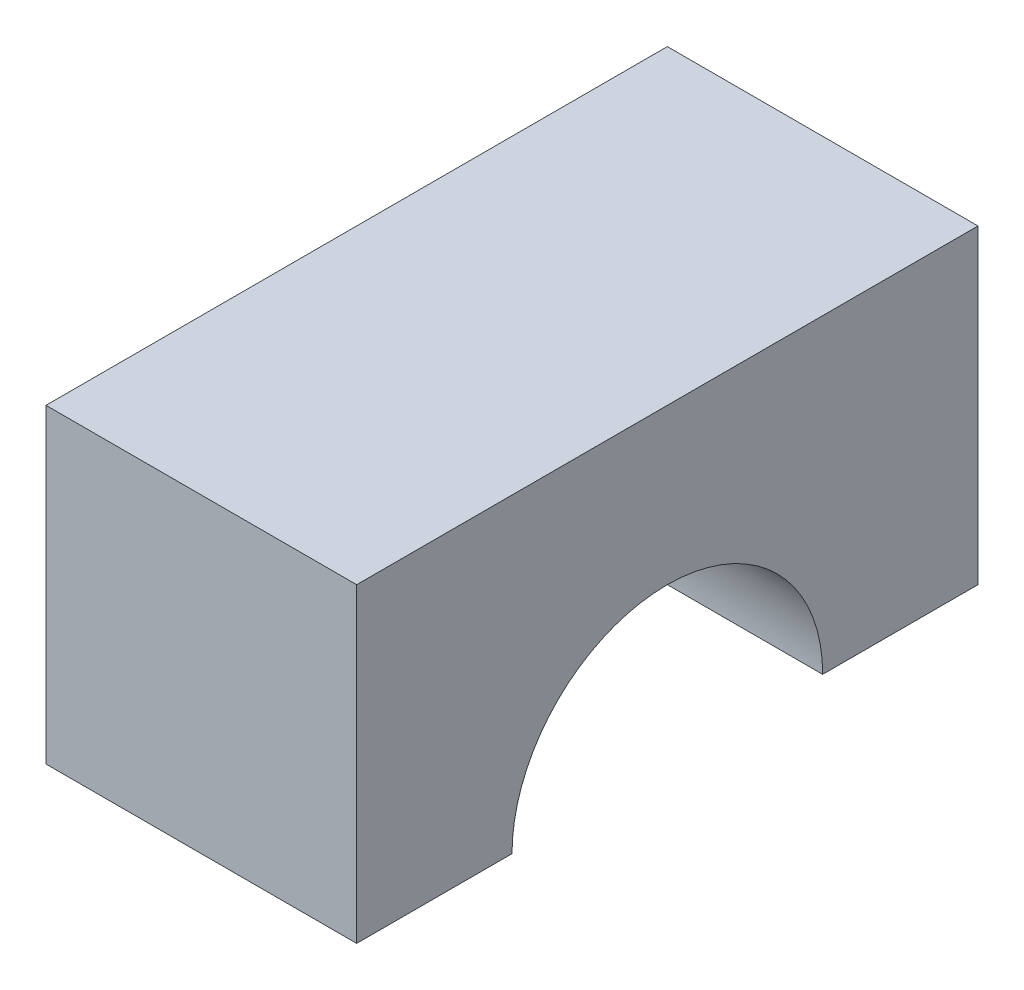
ISO-10303-21;
HEADER;
FILE_DESCRIPTION(('STEP AP214'),'2;1');
FILE_NAME('part.step','',(''),(''),'','','');
FILE_SCHEMA(('AUTOMOTIVE_DESIGN { 1 0 10303 214 1 1 1 1 }'));
ENDSEC;
DATA;
#1=APPLICATION_CONTEXT('core data for automotive mechanical design processes');
#2=APPLICATION_PROTOCOL_DEFINITION('international standard','automotive_design',2000,#1);
#3=PRODUCT_CONTEXT('',#1,'mechanical');
#4=PRODUCT('Part','Part','',(#3));
#5=PRODUCT_RELATED_PRODUCT_CATEGORY('part','',(#4));
#6=PRODUCT_DEFINITION_FORMATION('','',#4);
#7=PRODUCT_DEFINITION_CONTEXT('part definition',#1,'design');
#8=PRODUCT_DEFINITION('design','',#6,#7);
#9=PRODUCT_DEFINITION_SHAPE('','',#8);
#10=(LENGTH_UNIT() NAMED_UNIT(*) SI_UNIT(.MILLI.,.METRE.));
#11=(NAMED_UNIT(*) PLANE_ANGLE_UNIT() SI_UNIT($,.RADIAN.));
#12=(NAMED_UNIT(*) SI_UNIT($,.STERADIAN.) SOLID_ANGLE_UNIT());
#13=UNCERTAINTY_MEASURE_WITH_UNIT(LENGTH_MEASURE(1.E-05),#10,'distance_accuracy_value','');
#14=(GEOMETRIC_REPRESENTATION_CONTEXT(3) GLOBAL_UNCERTAINTY_ASSIGNED_CONTEXT((#13)) GLOBAL_UNIT_ASSIGNED_CONTEXT((#10,
#11,#12)) REPRESENTATION_CONTEXT('',''));
#15=CARTESIAN_POINT('',(0.,0.,0.));
#16=DIRECTION('',(0.,0.,1.));
#17=DIRECTION('',(1.,0.,0.));
#18=AXIS2_PLACEMENT_3D('',#15,#16,#17);
#19=CARTESIAN_POINT('',(25.4,0.,-25.4));
#20=DIRECTION('',(-1.,0.,0.));
#21=DIRECTION('',(0.,0.,1.));
#22=AXIS2_PLACEMENT_3D('',#19,#20,#21);
#23=CYLINDRICAL_SURFACE('',#22,12.7);
#24=CARTESIAN_POINT('',(0.,0.,-25.4));
#25=DIRECTION('',(1.,0.,0.));
#26=DIRECTION('',(0.,0.,-1.));
#27=AXIS2_PLACEMENT_3D('',#24,#25,#26);
#28=CIRCLE('',#27,12.7);
#29=CARTESIAN_POINT('',(0.,0.,-38.1));
#30=VERTEX_POINT('',#29);
#31=CARTESIAN_POINT('',(0.,0.,-12.7));
#32=VERTEX_POINT('',#31);
#33=EDGE_CURVE('E116',#30,#32,#28,.T.);
#34=ORIENTED_EDGE('',*,*,#33,.F.);
#35=DIRECTION('',(-1.,0.,0.));
#36=VECTOR('',#35,1.);
#37=CARTESIAN_POINT('',(25.4,0.,-38.1));
#38=LINE('',#37,#36);
#39=CARTESIAN_POINT('',(25.4,0.,-38.1));
#40=VERTEX_POINT('',#39);
#41=EDGE_CURVE('E11',#40,#30,#38,.T.);
#42=ORIENTED_EDGE('',*,*,#41,.F.);
#43=CARTESIAN_POINT('',(25.4,0.,-25.4));
#44=DIRECTION('',(1.,0.,0.));
#45=DIRECTION('',(0.,0.,-1.));
#46=AXIS2_PLACEMENT_3D('',#43,#44,#45);
#47=CIRCLE('',#46,12.7);
#48=CARTESIAN_POINT('',(25.4,0.,-12.7));
#49=VERTEX_POINT('',#48);
#50=EDGE_CURVE('E129',#40,#49,#47,.T.);
#51=ORIENTED_EDGE('',*,*,#50,.T.);
#52=DIRECTION('',(-1.,0.,0.));
#53=VECTOR('',#52,1.);
#54=CARTESIAN_POINT('',(25.4,0.,-12.7));
#55=LINE('',#54,#53);
#56=EDGE_CURVE('E79',#49,#32,#55,.T.);
#57=ORIENTED_EDGE('',*,*,#56,.T.);
#58=EDGE_LOOP('',(#34,#42,#51,#57));
#59=FACE_BOUND('',#58,.T.);
#60=ADVANCED_FACE('F35',(#59),#23,.F.);
#61=CARTESIAN_POINT('',(25.4,0.,0.));
#62=DIRECTION('',(0.,1.,0.));
#63=DIRECTION('',(0.,0.,1.));
#64=AXIS2_PLACEMENT_3D('',#61,#62,#63);
#65=PLANE('',#64);
#66=DIRECTION('',(0.,0.,-1.));
#67=VECTOR('',#66,1.);
#68=CARTESIAN_POINT('',(0.,0.,0.));
#69=LINE('',#68,#67);
#70=CARTESIAN_POINT('',(0.,0.,-50.8));
#71=VERTEX_POINT('',#70);
#72=EDGE_CURVE('E119',#30,#71,#69,.T.);
#73=ORIENTED_EDGE('',*,*,#72,.T.);
#74=DIRECTION('',(-1.,0.,0.));
#75=VECTOR('',#74,1.);
#76=CARTESIAN_POINT('',(25.4,0.,-50.8));
#77=LINE('',#76,#75);
#78=CARTESIAN_POINT('',(25.4,0.,-50.8));
#79=VERTEX_POINT('',#78);
#80=EDGE_CURVE('E43',#79,#71,#77,.T.);
#81=ORIENTED_EDGE('',*,*,#80,.F.);
#82=DIRECTION('',(0.,0.,-1.));
#83=VECTOR('',#82,1.);
#84=CARTESIAN_POINT('',(25.4,0.,0.));
#85=LINE('',#84,#83);
#86=EDGE_CURVE('E142',#40,#79,#85,.T.);
#87=ORIENTED_EDGE('',*,*,#86,.F.);
#88=ORIENTED_EDGE('',*,*,#41,.T.);
#89=EDGE_LOOP('',(#73,#81,#87,#88));
#90=FACE_BOUND('',#89,.T.);
#91=ADVANCED_FACE('F145',(#90),#65,.F.);
#92=CARTESIAN_POINT('',(25.4,0.,-50.8));
#93=DIRECTION('',(0.,0.,1.));
#94=DIRECTION('',(1.,0.,0.));
#95=AXIS2_PLACEMENT_3D('',#92,#93,#94);
#96=PLANE('',#95);
#97=DIRECTION('',(0.,1.,0.));
#98=VECTOR('',#97,1.);
#99=CARTESIAN_POINT('',(0.,0.,-50.8));
#100=LINE('',#99,#98);
#101=CARTESIAN_POINT('',(0.,25.4,-50.8));
#102=VERTEX_POINT('',#101);
#103=EDGE_CURVE('E121',#71,#102,#100,.T.);
#104=ORIENTED_EDGE('',*,*,#103,.T.);
#105=DIRECTION('',(-1.,0.,0.));
#106=VECTOR('',#105,1.);
#107=CARTESIAN_POINT('',(25.4,25.4,-50.8));
#108=LINE('',#107,#106);
#109=CARTESIAN_POINT('',(25.4,25.4,-50.8));
#110=VERTEX_POINT('',#109);
#111=EDGE_CURVE('E103',#110,#102,#108,.T.);
#112=ORIENTED_EDGE('',*,*,#111,.F.);
#113=DIRECTION('',(0.,1.,0.));
#114=VECTOR('',#113,1.);
#115=CARTESIAN_POINT('',(25.4,0.,-50.8));
#116=LINE('',#115,#114);
#117=EDGE_CURVE('E108',#79,#110,#116,.T.);
#118=ORIENTED_EDGE('',*,*,#117,.F.);
#119=ORIENTED_EDGE('',*,*,#80,.T.);
#120=EDGE_LOOP('',(#104,#112,#118,#119));
#121=FACE_BOUND('',#120,.T.);
#122=ADVANCED_FACE('F136',(#121),#96,.F.);
#123=CARTESIAN_POINT('',(25.4,25.4,0.));
#124=DIRECTION('',(0.,1.,0.));
#125=DIRECTION('',(0.,0.,1.));
#126=AXIS2_PLACEMENT_3D('',#123,#124,#125);
#127=PLANE('',#126);
#128=DIRECTION('',(0.,0.,-1.));
#129=VECTOR('',#128,1.);
#130=CARTESIAN_POINT('',(0.,25.4,0.));
#131=LINE('',#130,#129);
#132=CARTESIAN_POINT('',(0.,25.4,0.));
#133=VERTEX_POINT('',#132);
#134=EDGE_CURVE('E98',#133,#102,#131,.T.);
#135=ORIENTED_EDGE('',*,*,#134,.F.);
#136=DIRECTION('',(-1.,0.,0.));
#137=VECTOR('',#136,1.);
#138=CARTESIAN_POINT('',(25.4,25.4,0.));
#139=LINE('',#138,#137);
#140=CARTESIAN_POINT('',(25.4,25.4,0.));
#141=VERTEX_POINT('',#140);
#142=EDGE_CURVE('E93',#141,#133,#139,.T.);
#143=ORIENTED_EDGE('',*,*,#142,.F.);
#144=DIRECTION('',(0.,0.,-1.));
#145=VECTOR('',#144,1.);
#146=CARTESIAN_POINT('',(25.4,25.4,0.));
#147=LINE('',#146,#145);
#148=EDGE_CURVE('E96',#141,#110,#147,.T.);
#149=ORIENTED_EDGE('',*,*,#148,.T.);
#150=ORIENTED_EDGE('',*,*,#111,.T.);
#151=EDGE_LOOP('',(#135,#143,#149,#150));
#152=FACE_BOUND('',#151,.T.);
#153=ADVANCED_FACE('F95',(#152),#127,.T.);
#154=CARTESIAN_POINT('',(25.4,0.,0.));
#155=DIRECTION('',(0.,0.,1.));
#156=DIRECTION('',(1.,0.,0.));
#157=AXIS2_PLACEMENT_3D('',#154,#155,#156);
#158=PLANE('',#157);
#159=DIRECTION('',(0.,1.,0.));
#160=VECTOR('',#159,1.);
#161=CARTESIAN_POINT('',(0.,0.,0.));
#162=LINE('',#161,#160);
#163=CARTESIAN_POINT('',(0.,0.,0.));
#164=VERTEX_POINT('',#163);
#165=EDGE_CURVE('E125',#164,#133,#162,.T.);
#166=ORIENTED_EDGE('',*,*,#165,.F.);
#167=DIRECTION('',(-1.,0.,0.));
#168=VECTOR('',#167,1.);
#169=CARTESIAN_POINT('',(25.4,0.,0.));
#170=LINE('',#169,#168);
#171=CARTESIAN_POINT('',(25.4,0.,0.));
#172=VERTEX_POINT('',#171);
#173=EDGE_CURVE('E72',#172,#164,#170,.T.);
#174=ORIENTED_EDGE('',*,*,#173,.F.);
#175=DIRECTION('',(0.,1.,0.));
#176=VECTOR('',#175,1.);
#177=CARTESIAN_POINT('',(25.4,0.,0.));
#178=LINE('',#177,#176);
#179=EDGE_CURVE('E106',#172,#141,#178,.T.);
#180=ORIENTED_EDGE('',*,*,#179,.T.);
#181=ORIENTED_EDGE('',*,*,#142,.T.);
#182=EDGE_LOOP('',(#166,#174,#180,#181));
#183=FACE_BOUND('',#182,.T.);
#184=ADVANCED_FACE('F111',(#183),#158,.T.);
#185=CARTESIAN_POINT('',(25.4,0.,0.));
#186=DIRECTION('',(0.,1.,0.));
#187=DIRECTION('',(0.,0.,1.));
#188=AXIS2_PLACEMENT_3D('',#185,#186,#187);
#189=PLANE('',#188);
#190=DIRECTION('',(0.,0.,-1.));
#191=VECTOR('',#190,1.);
#192=CARTESIAN_POINT('',(0.,0.,0.));
#193=LINE('',#192,#191);
#194=EDGE_CURVE('E127',#164,#32,#193,.T.);
#195=ORIENTED_EDGE('',*,*,#194,.T.);
#196=ORIENTED_EDGE('',*,*,#56,.F.);
#197=DIRECTION('',(0.,0.,-1.));
#198=VECTOR('',#197,1.);
#199=CARTESIAN_POINT('',(25.4,0.,0.));
#200=LINE('',#199,#198);
#201=EDGE_CURVE('E51',#172,#49,#200,.T.);
#202=ORIENTED_EDGE('',*,*,#201,.F.);
#203=ORIENTED_EDGE('',*,*,#173,.T.);
#204=EDGE_LOOP('',(#195,#196,#202,#203));
#205=FACE_BOUND('',#204,.T.);
#206=ADVANCED_FACE('F141',(#205),#189,.F.);
#207=CARTESIAN_POINT('',(25.4,0.,0.));
#208=DIRECTION('',(1.,0.,0.));
#209=DIRECTION('',(0.,0.,-1.));
#210=AXIS2_PLACEMENT_3D('',#207,#208,#209);
#211=PLANE('',#210);
#212=ORIENTED_EDGE('',*,*,#50,.F.);
#213=ORIENTED_EDGE('',*,*,#86,.T.);
#214=ORIENTED_EDGE('',*,*,#117,.T.);
#215=ORIENTED_EDGE('',*,*,#148,.F.);
#216=ORIENTED_EDGE('',*,*,#179,.F.);
#217=ORIENTED_EDGE('',*,*,#201,.T.);
#218=EDGE_LOOP('',(#212,#213,#214,#215,#216,#217));
#219=FACE_BOUND('',#218,.T.);
#220=ADVANCED_FACE('F105',(#219),#211,.T.);
#221=CARTESIAN_POINT('',(0.,0.,0.));
#222=DIRECTION('',(1.,0.,0.));
#223=DIRECTION('',(0.,0.,-1.));
#224=AXIS2_PLACEMENT_3D('',#221,#222,#223);
#225=PLANE('',#224);
#226=ORIENTED_EDGE('',*,*,#33,.T.);
#227=ORIENTED_EDGE('',*,*,#194,.F.);
#228=ORIENTED_EDGE('',*,*,#165,.T.);
#229=ORIENTED_EDGE('',*,*,#134,.T.);
#230=ORIENTED_EDGE('',*,*,#103,.F.);
#231=ORIENTED_EDGE('',*,*,#72,.F.);
#232=EDGE_LOOP('',(#226,#227,#228,#229,#230,#231));
#233=FACE_BOUND('',#232,.T.);
#234=ADVANCED_FACE('F140',(#233),#225,.F.);
#235=CLOSED_SHELL('',(#60,#91,#122,#153,#184,#206,#220,#234));
#236=MANIFOLD_SOLID_BREP('B2',#235);
#237=ADVANCED_BREP_SHAPE_REPRESENTATION('',(#18,#236),#14);
#238=SHAPE_DEFINITION_REPRESENTATION(#9,#237);
ENDSEC;
END-ISO-10303-21;
